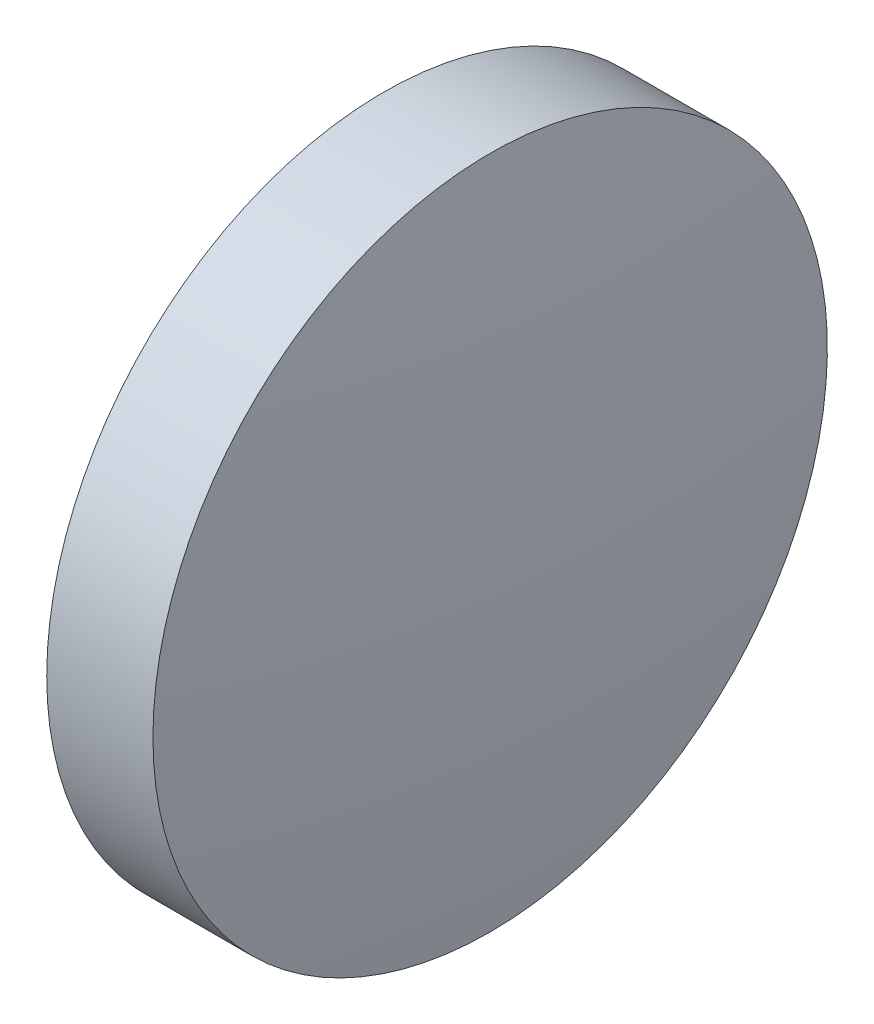
ISO-10303-21;
HEADER;
FILE_DESCRIPTION(('STEP AP214'),'2;1');
FILE_NAME('part.step','',(''),(''),'','','');
FILE_SCHEMA(('AUTOMOTIVE_DESIGN { 1 0 10303 214 1 1 1 1 }'));
ENDSEC;
DATA;
#1=APPLICATION_CONTEXT('core data for automotive mechanical design processes');
#2=APPLICATION_PROTOCOL_DEFINITION('international standard','automotive_design',2000,#1);
#3=PRODUCT_CONTEXT('',#1,'mechanical');
#4=PRODUCT('Part','Part','',(#3));
#5=PRODUCT_RELATED_PRODUCT_CATEGORY('part','',(#4));
#6=PRODUCT_DEFINITION_FORMATION('','',#4);
#7=PRODUCT_DEFINITION_CONTEXT('part definition',#1,'design');
#8=PRODUCT_DEFINITION('design','',#6,#7);
#9=PRODUCT_DEFINITION_SHAPE('','',#8);
#10=(LENGTH_UNIT() NAMED_UNIT(*) SI_UNIT(.MILLI.,.METRE.));
#11=(NAMED_UNIT(*) PLANE_ANGLE_UNIT() SI_UNIT($,.RADIAN.));
#12=(NAMED_UNIT(*) SI_UNIT($,.STERADIAN.) SOLID_ANGLE_UNIT());
#13=UNCERTAINTY_MEASURE_WITH_UNIT(LENGTH_MEASURE(1.E-05),#10,'distance_accuracy_value','');
#14=(GEOMETRIC_REPRESENTATION_CONTEXT(3) GLOBAL_UNCERTAINTY_ASSIGNED_CONTEXT((#13)) GLOBAL_UNIT_ASSIGNED_CONTEXT((#10,
#11,#12)) REPRESENTATION_CONTEXT('',''));
#15=CARTESIAN_POINT('',(0.,0.,0.));
#16=DIRECTION('',(0.,0.,1.));
#17=DIRECTION('',(1.,0.,0.));
#18=AXIS2_PLACEMENT_3D('',#15,#16,#17);
#19=CARTESIAN_POINT('',(411.558119984363,237.484622243316,0.));
#20=DIRECTION('',(-1.,0.,0.));
#21=DIRECTION('',(0.,-1.,0.));
#22=AXIS2_PLACEMENT_3D('',#19,#20,#21);
#23=SPHERICAL_SURFACE('',#22,50.603125);
#24=CARTESIAN_POINT('',(461.761244984363,237.484622243316,0.));
#25=DIRECTION('',(-1.,0.,0.));
#26=DIRECTION('',(0.,0.,1.));
#27=AXIS2_PLACEMENT_3D('',#24,#25,#26);
#28=CIRCLE('',#27,6.34999999999999);
#29=CARTESIAN_POINT('',(461.761244984363,237.484622243316,6.34999999999999));
#30=VERTEX_POINT('',#29);
#31=EDGE_CURVE('E10',#30,#30,#28,.T.);
#32=ORIENTED_EDGE('',*,*,#31,.F.);
#33=EDGE_LOOP('',(#32));
#34=FACE_BOUND('',#33,.T.);
#35=ADVANCED_FACE('F33',(#34),#23,.T.);
#36=CARTESIAN_POINT('',(457.500713838508,237.484622243316,0.));
#37=DIRECTION('',(-1.,0.,0.));
#38=DIRECTION('',(0.,0.,1.));
#39=AXIS2_PLACEMENT_3D('',#36,#37,#38);
#40=CYLINDRICAL_SURFACE('',#39,6.34999999999999);
#41=CARTESIAN_POINT('',(459.761244984363,237.484622243316,0.));
#42=DIRECTION('',(-1.,0.,0.));
#43=DIRECTION('',(0.,0.,1.));
#44=AXIS2_PLACEMENT_3D('',#41,#42,#43);
#45=CIRCLE('',#44,6.34999999999999);
#46=CARTESIAN_POINT('',(459.761244984363,237.484622243316,6.34999999999999));
#47=VERTEX_POINT('',#46);
#48=EDGE_CURVE('E39',#47,#47,#45,.T.);
#49=ORIENTED_EDGE('',*,*,#48,.F.);
#50=EDGE_LOOP('',(#49));
#51=FACE_BOUND('',#50,.T.);
#52=ORIENTED_EDGE('',*,*,#31,.T.);
#53=EDGE_LOOP('',(#52));
#54=FACE_BOUND('',#53,.T.);
#55=ADVANCED_FACE('F47',(#51,#54),#40,.T.);
#56=CARTESIAN_POINT('',(459.761244984363,237.484622243316,0.));
#57=DIRECTION('',(1.,0.,0.));
#58=DIRECTION('',(0.,0.,-1.));
#59=AXIS2_PLACEMENT_3D('',#56,#57,#58);
#60=PLANE('',#59);
#61=ORIENTED_EDGE('',*,*,#48,.T.);
#62=EDGE_LOOP('',(#61));
#63=FACE_BOUND('',#62,.T.);
#64=ADVANCED_FACE('F45',(#63),#60,.F.);
#65=CLOSED_SHELL('',(#35,#55,#64));
#66=MANIFOLD_SOLID_BREP('B2',#65);
#67=ADVANCED_BREP_SHAPE_REPRESENTATION('',(#18,#66),#14);
#68=SHAPE_DEFINITION_REPRESENTATION(#9,#67);
ENDSEC;
END-ISO-10303-21;
